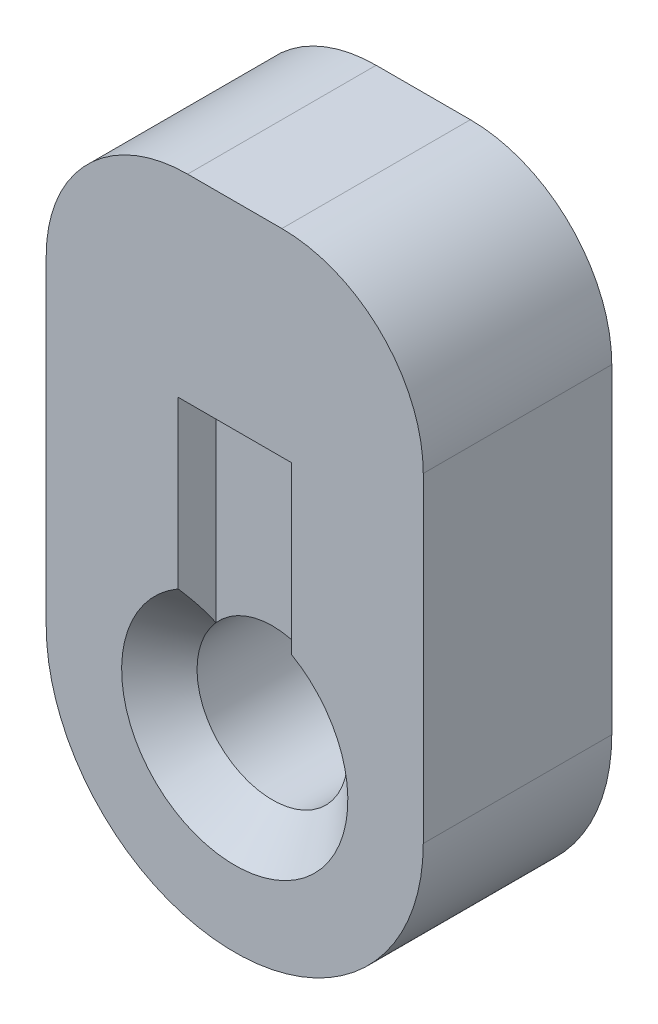
ISO-10303-21;
HEADER;
FILE_DESCRIPTION(('STEP AP214'),'2;1');
FILE_NAME('part.step','',(''),(''),'','','');
FILE_SCHEMA(('AUTOMOTIVE_DESIGN { 1 0 10303 214 1 1 1 1 }'));
ENDSEC;
DATA;
#1=APPLICATION_CONTEXT('core data for automotive mechanical design processes');
#2=APPLICATION_PROTOCOL_DEFINITION('international standard','automotive_design',2000,#1);
#3=PRODUCT_CONTEXT('',#1,'mechanical');
#4=PRODUCT('Part','Part','',(#3));
#5=PRODUCT_RELATED_PRODUCT_CATEGORY('part','',(#4));
#6=PRODUCT_DEFINITION_FORMATION('','',#4);
#7=PRODUCT_DEFINITION_CONTEXT('part definition',#1,'design');
#8=PRODUCT_DEFINITION('design','',#6,#7);
#9=PRODUCT_DEFINITION_SHAPE('','',#8);
#10=(LENGTH_UNIT() NAMED_UNIT(*) SI_UNIT(.MILLI.,.METRE.));
#11=(NAMED_UNIT(*) PLANE_ANGLE_UNIT() SI_UNIT($,.RADIAN.));
#12=(NAMED_UNIT(*) SI_UNIT($,.STERADIAN.) SOLID_ANGLE_UNIT());
#13=UNCERTAINTY_MEASURE_WITH_UNIT(LENGTH_MEASURE(1.E-05),#10,'distance_accuracy_value','');
#14=(GEOMETRIC_REPRESENTATION_CONTEXT(3) GLOBAL_UNCERTAINTY_ASSIGNED_CONTEXT((#13)) GLOBAL_UNIT_ASSIGNED_CONTEXT((#10,
#11,#12)) REPRESENTATION_CONTEXT('',''));
#15=CARTESIAN_POINT('',(0.,0.,0.));
#16=DIRECTION('',(0.,0.,1.));
#17=DIRECTION('',(1.,0.,0.));
#18=AXIS2_PLACEMENT_3D('',#15,#16,#17);
#19=CARTESIAN_POINT('',(0.,0.,2.54));
#20=DIRECTION('',(0.,0.,-1.));
#21=DIRECTION('',(-1.,0.,0.));
#22=AXIS2_PLACEMENT_3D('',#19,#20,#21);
#23=CYLINDRICAL_SURFACE('',#22,1.016);
#24=CARTESIAN_POINT('',(0.,0.,0.508));
#25=DIRECTION('',(0.,0.,-1.));
#26=DIRECTION('',(-1.,0.,0.));
#27=AXIS2_PLACEMENT_3D('',#24,#25,#26);
#28=CIRCLE('',#27,1.016);
#29=CARTESIAN_POINT('',(0.762,0.672020833010429,0.508));
#30=VERTEX_POINT('',#29);
#31=CARTESIAN_POINT('',(-0.762000000000013,0.672020833010416,0.508));
#32=VERTEX_POINT('',#31);
#33=EDGE_CURVE('E519',#30,#32,#28,.F.);
#34=ORIENTED_EDGE('',*,*,#33,.F.);
#35=CARTESIAN_POINT('',(0.,0.,0.508000000000016));
#36=DIRECTION('',(0.,0.,-1.));
#37=DIRECTION('',(-1.,0.,0.));
#38=AXIS2_PLACEMENT_3D('',#35,#36,#37);
#39=CIRCLE('',#38,1.016);
#40=EDGE_CURVE('E139',#30,#32,#39,.T.);
#41=ORIENTED_EDGE('',*,*,#40,.T.);
#42=EDGE_LOOP('',(#34,#41));
#43=FACE_BOUND('',#42,.T.);
#44=CARTESIAN_POINT('',(0.,0.,2.032));
#45=DIRECTION('',(0.,0.,1.));
#46=DIRECTION('',(1.,0.,0.));
#47=AXIS2_PLACEMENT_3D('',#44,#45,#46);
#48=CIRCLE('',#47,1.016);
#49=CARTESIAN_POINT('',(-0.762000000000001,0.672020833010413,2.032));
#50=VERTEX_POINT('',#49);
#51=CARTESIAN_POINT('',(0.762000000000004,0.672020833010409,2.032));
#52=VERTEX_POINT('',#51);
#53=EDGE_CURVE('E179',#50,#52,#48,.F.);
#54=ORIENTED_EDGE('',*,*,#53,.F.);
#55=CARTESIAN_POINT('',(0.,0.,2.03199999999999));
#56=DIRECTION('',(0.,0.,1.));
#57=DIRECTION('',(1.,0.,0.));
#58=AXIS2_PLACEMENT_3D('',#55,#56,#57);
#59=CIRCLE('',#58,1.016);
#60=EDGE_CURVE('E158',#50,#52,#59,.T.);
#61=ORIENTED_EDGE('',*,*,#60,.T.);
#62=EDGE_LOOP('',(#54,#61));
#63=FACE_BOUND('',#62,.T.);
#64=ADVANCED_FACE('F38',(#43,#63),#23,.F.);
#65=CARTESIAN_POINT('',(-0.762000000000001,0.,2.032));
#66=DIRECTION('',(-1.,0.,0.));
#67=DIRECTION('',(0.,0.,1.));
#68=AXIS2_PLACEMENT_3D('',#65,#66,#67);
#69=PLANE('',#68);
#70=CARTESIAN_POINT('',(-0.762000000000001,-0.320112885029406,1.84250847494859));
#71=CARTESIAN_POINT('',(-0.762000000000001,-0.295333553365384,1.83290636944236));
#72=CARTESIAN_POINT('',(-0.762000000000001,-0.270205778967705,1.82412531153175));
#73=CARTESIAN_POINT('',(-0.762000000000001,-0.219279308727766,1.80855318599059));
#74=CARTESIAN_POINT('',(-0.762000000000001,-0.193479145095385,1.80176695346473));
#75=CARTESIAN_POINT('',(-0.762000000000001,-0.141824715607705,1.79068312579393));
#76=CARTESIAN_POINT('',(-0.762000000000001,-0.115979848676879,1.78634278389228));
#77=CARTESIAN_POINT('',(-0.762000000000001,-0.0640080043353284,1.78024889633141));
#78=CARTESIAN_POINT('',(-0.762000000000001,-0.0378813393353045,1.7784927338415));
#79=CARTESIAN_POINT('',(-0.762000000000001,0.0135364612752595,1.77770144140581));
#80=CARTESIAN_POINT('',(-0.762000000000001,0.0388261998534757,1.77857693857625));
#81=CARTESIAN_POINT('',(-0.762000000000001,0.089204692449845,1.78279152828026));
#82=CARTESIAN_POINT('',(-0.762000000000001,0.114293344654479,1.78613179782516));
#83=CARTESIAN_POINT('',(-0.762000000000001,0.188998481514829,1.79956372082769));
#84=CARTESIAN_POINT('',(-0.762000000000001,0.238010241197525,1.81306659996416));
#85=CARTESIAN_POINT('',(-0.762000000000001,0.335647478318469,1.84732319180735));
#86=CARTESIAN_POINT('',(-0.762000000000001,0.384165580939922,1.86836391130572));
#87=CARTESIAN_POINT('',(-0.762000000000001,0.478965921312955,1.91508463327411));
#88=CARTESIAN_POINT('',(-0.762000000000001,0.525243542700618,1.94077373742472));
#89=CARTESIAN_POINT('',(-0.762000000000001,0.616770009042437,1.99563444778393));
#90=CARTESIAN_POINT('',(-0.762000000000001,0.661986045509693,2.02485974331733));
#91=CARTESIAN_POINT('',(-0.762000000000001,0.750951469043454,2.08535304604002));
#92=CARTESIAN_POINT('',(-0.762000000000001,0.794702182311347,2.11661912622096));
#93=CARTESIAN_POINT('',(-0.762000000000001,0.911413460169346,2.2029502583023));
#94=CARTESIAN_POINT('',(-0.762000000000001,0.983379073223906,2.25935171884097));
#95=CARTESIAN_POINT('',(-0.762000000000001,1.12542139977116,2.37449674969511));
#96=CARTESIAN_POINT('',(-0.762000000000001,1.19549743360379,2.43324114438863));
#97=CARTESIAN_POINT('',(-0.762000000000001,1.33448584164571,2.55229764416072));
#98=CARTESIAN_POINT('',(-0.762000000000001,1.40339628502007,2.61261199660617));
#99=CARTESIAN_POINT('',(-0.762000000000001,1.54034092149377,2.73422808104102));
#100=CARTESIAN_POINT('',(-0.762000000000001,1.60837508129857,2.79552985034949));
#101=CARTESIAN_POINT('',(-0.762000000000001,1.73708890097997,2.9127042284456));
#102=CARTESIAN_POINT('',(-0.762000000000001,1.79782808883558,2.96851157096941));
#103=CARTESIAN_POINT('',(-0.762000000000001,1.91891904470457,3.08055019785734));
#104=CARTESIAN_POINT('',(-0.762000000000001,1.97927079436488,3.13678150203428));
#105=CARTESIAN_POINT('',(-0.762000000000001,2.09948522538936,3.24939197548309));
#106=CARTESIAN_POINT('',(-0.762000000000001,2.15934884272821,3.3057701466671));
#107=CARTESIAN_POINT('',(-0.762000000000001,2.27883046181757,3.41877836535408));
#108=CARTESIAN_POINT('',(-0.762000000000001,2.33844847952092,3.47540839598437));
#109=CARTESIAN_POINT('',(-0.762000000000001,2.39797516397831,3.53213371803982));
#110=B_SPLINE_CURVE_WITH_KNOTS('',3,(#70,#71,#72,#73,#74,#75,#76,#77,#78,#79,#80,#81,#82,#83,
#84,#85,#86,#87,#88,#89,#90,#91,#92,#93,#94,#95,#96,#97,#98,#99,#100,#101,#102,#103,#104,#105,
#106,#107,#108,#109),.UNSPECIFIED.,.F.,.F.,(4,2,2,2,2,2,2,2,2,2,2,2,2,2,2,2,2,2,2,4),(0.,
0.0797522408543494,0.159696222594933,0.238195867700949,0.31661596647901,0.392403294084258,
0.468226836116276,0.620003493762815,0.778311228022764,0.936932355595322,1.09836706998341,
1.25965149539109,1.53385513955007,1.80815613042058,2.08287409239533,2.35760246171224,
2.60505370840901,2.85251659170748,3.0992126774344,3.34589247812601),.UNSPECIFIED.);
#111=CARTESIAN_POINT('',(-0.762000000000001,1.31982271536748,2.54));
#112=VERTEX_POINT('',#111);
#113=EDGE_CURVE('E163',#50,#112,#110,.T.);
#114=ORIENTED_EDGE('',*,*,#113,.F.);
#115=DIRECTION('',(0.,-1.,0.));
#116=VECTOR('',#115,1.);
#117=CARTESIAN_POINT('',(-0.762000000000001,0.,2.032));
#118=LINE('',#117,#116);
#119=CARTESIAN_POINT('',(-0.762000000000001,3.556,2.032));
#120=VERTEX_POINT('',#119);
#121=EDGE_CURVE('E176',#120,#50,#118,.T.);
#122=ORIENTED_EDGE('',*,*,#121,.F.);
#123=DIRECTION('',(0.,0.,1.));
#124=VECTOR('',#123,1.);
#125=CARTESIAN_POINT('',(-0.762000000000001,3.556,2.032));
#126=LINE('',#125,#124);
#127=CARTESIAN_POINT('',(-0.762000000000001,3.556,2.54));
#128=VERTEX_POINT('',#127);
#129=EDGE_CURVE('E196',#120,#128,#126,.T.);
#130=ORIENTED_EDGE('',*,*,#129,.T.);
#131=DIRECTION('',(0.,-1.,0.));
#132=VECTOR('',#131,1.);
#133=CARTESIAN_POINT('',(-0.762000000000001,0.,2.54));
#134=LINE('',#133,#132);
#135=EDGE_CURVE('E172',#128,#112,#134,.T.);
#136=ORIENTED_EDGE('',*,*,#135,.T.);
#137=EDGE_LOOP('',(#114,#122,#130,#136));
#138=FACE_BOUND('',#137,.T.);
#139=ADVANCED_FACE('F277',(#138),#69,.F.);
#140=CARTESIAN_POINT('',(0.762000000000001,0.,2.032));
#141=DIRECTION('',(1.,0.,0.));
#142=DIRECTION('',(0.,1.,0.));
#143=AXIS2_PLACEMENT_3D('',#140,#141,#142);
#144=PLANE('',#143);
#145=CARTESIAN_POINT('',(0.762,2.39797516397831,3.53213371803981));
#146=CARTESIAN_POINT('',(0.762,2.32873931674914,3.46616039267172));
#147=CARTESIAN_POINT('',(0.762,2.25938285096078,3.40031275907171));
#148=CARTESIAN_POINT('',(0.762,2.12032476999515,3.26897252871197));
#149=CARTESIAN_POINT('',(0.762,2.050623129003,3.20347995929806));
#150=CARTESIAN_POINT('',(0.762,1.91093693713539,3.07310884917095));
#151=CARTESIAN_POINT('',(0.762,1.840953361568,3.0082292660561));
#152=CARTESIAN_POINT('',(0.762,1.70039435861494,2.87912022187955));
#153=CARTESIAN_POINT('',(0.762,1.6298189537208,2.81489073631485));
#154=CARTESIAN_POINT('',(0.762,1.46664134261578,2.66827439786695));
#155=CARTESIAN_POINT('',(0.762,1.3737586389346,2.58619666171781));
#156=CARTESIAN_POINT('',(0.762,1.23263801134836,2.46495534199683));
#157=CARTESIAN_POINT('',(0.762,1.18524464164697,2.42481050048725));
#158=CARTESIAN_POINT('',(0.762,1.08970679767788,2.34543347189523));
#159=CARTESIAN_POINT('',(0.762,1.04156242296529,2.30620116553391));
#160=CARTESIAN_POINT('',(0.762,0.947477847785198,2.23156286423435));
#161=CARTESIAN_POINT('',(0.762,0.901602549094888,2.19607544441393));
#162=CARTESIAN_POINT('',(0.762,0.80866866053499,2.12668940794581));
#163=CARTESIAN_POINT('',(0.762,0.761610291067495,2.09279049868499));
#164=CARTESIAN_POINT('',(0.762,0.665924682694298,2.02737427180279));
#165=CARTESIAN_POINT('',(0.762,0.617299242056743,1.99585435397701));
#166=CARTESIAN_POINT('',(0.762,0.517890221653922,1.93646959833464));
#167=CARTESIAN_POINT('',(0.762000000000001,0.467109404827834,1.90860025772468));
#168=CARTESIAN_POINT('',(0.762000000000001,0.367695882962378,1.861058228643));
#169=CARTESIAN_POINT('',(0.762000000000001,0.31932355521645,1.84085603108713));
#170=CARTESIAN_POINT('',(0.762000000000001,0.220205152376706,1.8078278857344));
#171=CARTESIAN_POINT('',(0.762000000000001,0.169471551906662,1.79496708311052));
#172=CARTESIAN_POINT('',(0.762000000000001,0.0918201824293839,1.7830719736912));
#173=CARTESIAN_POINT('',(0.762000000000001,0.0654557860224722,1.78034861998438));
#174=CARTESIAN_POINT('',(0.762000000000001,0.0125801610505859,1.77764797533753));
#175=CARTESIAN_POINT('',(0.762000000000001,-0.0139310649855619,1.77767063724941));
#176=CARTESIAN_POINT('',(0.762000000000001,-0.0668797202015237,1.78047036915518));
#177=CARTESIAN_POINT('',(0.762000000000001,-0.0933167177784668,1.78325536159827));
#178=CARTESIAN_POINT('',(0.762000000000001,-0.145795105763024,1.79138862314452));
#179=CARTESIAN_POINT('',(0.762000000000001,-0.171836374335675,1.79673766579477));
#180=CARTESIAN_POINT('',(0.762000000000001,-0.218464555083557,1.80844029670378));
#181=CARTESIAN_POINT('',(0.762000000000001,-0.23915007949053,1.81441154810352));
#182=CARTESIAN_POINT('',(0.762000000000001,-0.279998495995666,1.82758572915144));
#183=CARTESIAN_POINT('',(0.762000000000001,-0.30016367422565,1.83478153796503));
#184=CARTESIAN_POINT('',(0.762000000000001,-0.320112885029432,1.84250847494848));
#185=B_SPLINE_CURVE_WITH_KNOTS('',3,(#145,#146,#147,#148,#149,#150,#151,#152,#153,#154,#155,
#156,#157,#158,#159,#160,#161,#162,#163,#164,#165,#166,#167,#168,#169,#170,#171,#172,#173,#174,
#175,#176,#177,#178,#179,#180,#181,#182,#183,#184),.UNSPECIFIED.,.F.,.F.,(4,2,2,2,2,2,2,2,2,2,2,
2,2,2,2,2,2,2,2,4),(0.,0.28690614863427,0.573834088531817,0.860123242809433,1.14640156599761,
1.51822037764353,1.70454484153626,1.89084481222558,2.06481940011078,2.23876181383742,
2.41251127181324,2.58604435947118,2.74295026876841,2.89910490214274,2.97849141537674,
3.05787656557321,3.13749005510215,3.21712757831782,3.28167668025887,3.34586250911327),.UNSPECIFIED.);
#186=CARTESIAN_POINT('',(0.762,1.31982271536748,2.54));
#187=VERTEX_POINT('',#186);
#188=EDGE_CURVE('E305',#187,#52,#185,.T.);
#189=ORIENTED_EDGE('',*,*,#188,.F.);
#190=DIRECTION('',(0.,1.,0.));
#191=VECTOR('',#190,1.);
#192=CARTESIAN_POINT('',(0.762000000000001,0.,2.54));
#193=LINE('',#192,#191);
#194=CARTESIAN_POINT('',(0.761999999999999,3.556,2.54));
#195=VERTEX_POINT('',#194);
#196=EDGE_CURVE('E192',#187,#195,#193,.T.);
#197=ORIENTED_EDGE('',*,*,#196,.T.);
#198=DIRECTION('',(0.,0.,1.));
#199=VECTOR('',#198,1.);
#200=CARTESIAN_POINT('',(0.761999999999999,3.556,2.032));
#201=LINE('',#200,#199);
#202=CARTESIAN_POINT('',(0.761999999999999,3.556,2.032));
#203=VERTEX_POINT('',#202);
#204=EDGE_CURVE('E189',#203,#195,#201,.T.);
#205=ORIENTED_EDGE('',*,*,#204,.F.);
#206=DIRECTION('',(0.,1.,0.));
#207=VECTOR('',#206,1.);
#208=CARTESIAN_POINT('',(0.762000000000001,0.,2.032));
#209=LINE('',#208,#207);
#210=EDGE_CURVE('E183',#52,#203,#209,.T.);
#211=ORIENTED_EDGE('',*,*,#210,.F.);
#212=EDGE_LOOP('',(#189,#197,#205,#211));
#213=FACE_BOUND('',#212,.T.);
#214=ADVANCED_FACE('F283',(#213),#144,.F.);
#215=CARTESIAN_POINT('',(0.762000000000001,0.,0.508));
#216=DIRECTION('',(1.,0.,0.));
#217=DIRECTION('',(0.,1.,0.));
#218=AXIS2_PLACEMENT_3D('',#215,#216,#217);
#219=PLANE('',#218);
#220=CARTESIAN_POINT('',(0.762000000000001,-0.320112885029424,0.697491525051413));
#221=CARTESIAN_POINT('',(0.762000000000001,-0.2953335533654,0.707093630557645));
#222=CARTESIAN_POINT('',(0.762000000000001,-0.27020577896772,0.715874688468248));
#223=CARTESIAN_POINT('',(0.762000000000001,-0.219279308727779,0.731446814009408));
#224=CARTESIAN_POINT('',(0.762000000000001,-0.193479145095397,0.738233046535275));
#225=CARTESIAN_POINT('',(0.762000000000001,-0.141824715607715,0.749316874206072));
#226=CARTESIAN_POINT('',(0.762000000000001,-0.115979848676887,0.753657216107724));
#227=CARTESIAN_POINT('',(0.762000000000001,-0.0640080043353342,0.759751103668595));
#228=CARTESIAN_POINT('',(0.762000000000001,-0.037881339335309,0.761507266158503));
#229=CARTESIAN_POINT('',(0.762000000000001,0.0135364612752571,0.762298558594195));
#230=CARTESIAN_POINT('',(0.762000000000001,0.0388261998534742,0.761423061423751));
#231=CARTESIAN_POINT('',(0.762000000000001,0.0892046924498453,0.757208471719742));
#232=CARTESIAN_POINT('',(0.762000000000001,0.11429334465448,0.753868202174842));
#233=CARTESIAN_POINT('',(0.762000000000001,0.188998481514833,0.740436279172312));
#234=CARTESIAN_POINT('',(0.762000000000001,0.238010241197531,0.726933400035848));
#235=CARTESIAN_POINT('',(0.762000000000001,0.335647478318479,0.692676808192649));
#236=CARTESIAN_POINT('',(0.762000000000001,0.384165580939933,0.671636088694282));
#237=CARTESIAN_POINT('',(0.762000000000001,0.47896592131297,0.624915366725886));
#238=CARTESIAN_POINT('',(0.762,0.525243542700636,0.59922626257528));
#239=CARTESIAN_POINT('',(0.762,0.616770009042458,0.544365552216063));
#240=CARTESIAN_POINT('',(0.762,0.661986045509717,0.515140256682668));
#241=CARTESIAN_POINT('',(0.762,0.750951469043482,0.454646953959971));
#242=CARTESIAN_POINT('',(0.762,0.794702182311376,0.423380873779028));
#243=CARTESIAN_POINT('',(0.762,0.911413460169378,0.33704974169769));
#244=CARTESIAN_POINT('',(0.762,0.983379073223939,0.280648281159015));
#245=CARTESIAN_POINT('',(0.762,1.1254213997712,0.165503250304881));
#246=CARTESIAN_POINT('',(0.762,1.19549743360383,0.106758855611355));
#247=CARTESIAN_POINT('',(0.762,1.33448584164575,-0.0122976441607343));
#248=CARTESIAN_POINT('',(0.762,1.40339628502011,-0.0726119966061819));
#249=CARTESIAN_POINT('',(0.762,1.54034092149381,-0.194228081041035));
#250=CARTESIAN_POINT('',(0.762,1.60837508129862,-0.255529850349503));
#251=CARTESIAN_POINT('',(0.762,1.73708890098001,-0.372704228445616));
#252=CARTESIAN_POINT('',(0.762,1.79782808883563,-0.42851157096942));
#253=CARTESIAN_POINT('',(0.762,1.91891904470461,-0.540550197857357));
#254=CARTESIAN_POINT('',(0.762,1.97927079436492,-0.596781502034295));
#255=CARTESIAN_POINT('',(0.762,2.09948522538942,-0.709391975483098));
#256=CARTESIAN_POINT('',(0.762,2.15934884272826,-0.765770146667111));
#257=CARTESIAN_POINT('',(0.762,2.27883046181762,-0.878778365354089));
#258=CARTESIAN_POINT('',(0.762,2.33844847952097,-0.935408395984384));
#259=CARTESIAN_POINT('',(0.762,2.39797516397837,-0.99213371803983));
#260=B_SPLINE_CURVE_WITH_KNOTS('',3,(#220,#221,#222,#223,#224,#225,#226,#227,#228,#229,#230,
#231,#232,#233,#234,#235,#236,#237,#238,#239,#240,#241,#242,#243,#244,#245,#246,#247,#248,#249,
#250,#251,#252,#253,#254,#255,#256,#257,#258,#259),.UNSPECIFIED.,.F.,.F.,(4,2,2,2,2,2,2,2,2,2,2,
2,2,2,2,2,2,2,2,4),(0.,0.0797522408543532,0.159696222594941,0.23819586770096,0.316615966479025,
0.392403294084276,0.468226836116297,0.620003493762841,0.778311228022797,0.936932355595361,
1.09836706998345,1.25965149539114,1.53385513955013,1.80815613042064,2.08287409239539,
2.3576024617123,2.60505370840908,2.85251659170755,3.09921267743447,3.34589247812608),.UNSPECIFIED.);
#261=CARTESIAN_POINT('',(0.762,1.31982271536751,0.));
#262=VERTEX_POINT('',#261);
#263=EDGE_CURVE('E136',#30,#262,#260,.T.);
#264=ORIENTED_EDGE('',*,*,#263,.F.);
#265=DIRECTION('',(0.,-1.,0.));
#266=VECTOR('',#265,1.);
#267=CARTESIAN_POINT('',(0.762000000000001,0.,0.508));
#268=LINE('',#267,#266);
#269=CARTESIAN_POINT('',(0.761999999999999,3.556,0.508));
#270=VERTEX_POINT('',#269);
#271=EDGE_CURVE('E170',#270,#30,#268,.T.);
#272=ORIENTED_EDGE('',*,*,#271,.F.);
#273=DIRECTION('',(0.,0.,-1.));
#274=VECTOR('',#273,1.);
#275=CARTESIAN_POINT('',(0.761999999999999,3.556,0.508));
#276=LINE('',#275,#274);
#277=CARTESIAN_POINT('',(0.761999999999999,3.556,0.));
#278=VERTEX_POINT('',#277);
#279=EDGE_CURVE('E156',#270,#278,#276,.T.);
#280=ORIENTED_EDGE('',*,*,#279,.T.);
#281=DIRECTION('',(0.,-1.,0.));
#282=VECTOR('',#281,1.);
#283=CARTESIAN_POINT('',(0.762000000000001,0.,0.));
#284=LINE('',#283,#282);
#285=EDGE_CURVE('E152',#278,#262,#284,.T.);
#286=ORIENTED_EDGE('',*,*,#285,.T.);
#287=EDGE_LOOP('',(#264,#272,#280,#286));
#288=FACE_BOUND('',#287,.T.);
#289=ADVANCED_FACE('F155',(#288),#219,.F.);
#290=CARTESIAN_POINT('',(-0.762000000000001,0.,0.508));
#291=DIRECTION('',(-1.,0.,0.));
#292=DIRECTION('',(0.,0.,1.));
#293=AXIS2_PLACEMENT_3D('',#290,#291,#292);
#294=PLANE('',#293);
#295=CARTESIAN_POINT('',(-0.762000000000001,2.39797516397838,-0.992133718039835));
#296=CARTESIAN_POINT('',(-0.762000000000001,2.3287393167492,-0.92616039267174));
#297=CARTESIAN_POINT('',(-0.762000000000001,2.25938285096084,-0.860312759071731));
#298=CARTESIAN_POINT('',(-0.762000000000001,2.12032476999521,-0.728972528711984));
#299=CARTESIAN_POINT('',(-0.762000000000001,2.05062312900305,-0.663479959298074));
#300=CARTESIAN_POINT('',(-0.762000000000001,1.91093693713544,-0.533108849170966));
#301=CARTESIAN_POINT('',(-0.762000000000001,1.84095336156804,-0.468229266056115));
#302=CARTESIAN_POINT('',(-0.762000000000001,1.70039435861499,-0.339120221879564));
#303=CARTESIAN_POINT('',(-0.762000000000001,1.62981895372084,-0.274890736314859));
#304=CARTESIAN_POINT('',(-0.762000000000001,1.46664134261582,-0.128274397866957));
#305=CARTESIAN_POINT('',(-0.762000000000001,1.37375863893464,-0.0461966617178121));
#306=CARTESIAN_POINT('',(-0.762000000000001,1.23263801134839,0.0750446580031614));
#307=CARTESIAN_POINT('',(-0.762000000000001,1.18524464164699,0.115189499512746));
#308=CARTESIAN_POINT('',(-0.762000000000001,1.0897067976779,0.194566528104768));
#309=CARTESIAN_POINT('',(-0.762000000000001,1.04156242296531,0.233798834466091));
#310=CARTESIAN_POINT('',(-0.762000000000001,0.947477847785219,0.308437135765644));
#311=CARTESIAN_POINT('',(-0.762000000000001,0.901602549094908,0.343924555586069));
#312=CARTESIAN_POINT('',(-0.762000000000001,0.808668660535009,0.413310592054184));
#313=CARTESIAN_POINT('',(-0.762000000000001,0.761610291067513,0.447209501315008));
#314=CARTESIAN_POINT('',(-0.762000000000001,0.665924682694314,0.512625728197209));
#315=CARTESIAN_POINT('',(-0.762000000000001,0.617299242056758,0.544145646022987));
#316=CARTESIAN_POINT('',(-0.762000000000001,0.517890221653935,0.603530401665366));
#317=CARTESIAN_POINT('',(-0.762000000000001,0.467109404827846,0.631399742275319));
#318=CARTESIAN_POINT('',(-0.762000000000001,0.367695882962388,0.678941771356999));
#319=CARTESIAN_POINT('',(-0.762000000000001,0.319323555216459,0.699143968912871));
#320=CARTESIAN_POINT('',(-0.762000000000001,0.220205152376712,0.732172114265605));
#321=CARTESIAN_POINT('',(-0.762000000000001,0.169471551906666,0.745032916889488));
#322=CARTESIAN_POINT('',(-0.762000000000001,0.0918201824293863,0.756928026308806));
#323=CARTESIAN_POINT('',(-0.762000000000001,0.0654557860224739,0.759651380015625));
#324=CARTESIAN_POINT('',(-0.762000000000001,0.0125801610505861,0.762352024662472));
#325=CARTESIAN_POINT('',(-0.762000000000001,-0.0139310649855625,0.762329362750596));
#326=CARTESIAN_POINT('',(-0.762000000000001,-0.0668797202015259,0.759529630844824));
#327=CARTESIAN_POINT('',(-0.762000000000001,-0.09331671777847,0.756744638401739));
#328=CARTESIAN_POINT('',(-0.762000000000001,-0.145795105763029,0.748611376855485));
#329=CARTESIAN_POINT('',(-0.762000000000001,-0.17183637433568,0.743262334205238));
#330=CARTESIAN_POINT('',(-0.762000000000001,-0.218464555083565,0.731559703296227));
#331=CARTESIAN_POINT('',(-0.762000000000001,-0.239150079490541,0.725588451896481));
#332=CARTESIAN_POINT('',(-0.762000000000001,-0.279998495995681,0.712414270848565));
#333=CARTESIAN_POINT('',(-0.762000000000001,-0.300163674225667,0.70521846203497));
#334=CARTESIAN_POINT('',(-0.762000000000001,-0.320112885029451,0.69749152505152));
#335=B_SPLINE_CURVE_WITH_KNOTS('',3,(#295,#296,#297,#298,#299,#300,#301,#302,#303,#304,#305,
#306,#307,#308,#309,#310,#311,#312,#313,#314,#315,#316,#317,#318,#319,#320,#321,#322,#323,#324,
#325,#326,#327,#328,#329,#330,#331,#332,#333,#334),.UNSPECIFIED.,.F.,.F.,(4,2,2,2,2,2,2,2,2,2,2,
2,2,2,2,2,2,2,2,4),(0.,0.286906148634278,0.573834088531832,0.860123242809456,1.14640156599764,
1.51822037764357,1.7045448415363,1.89084481222563,2.06481940011083,2.23876181383748,
2.4125112718133,2.58604435947124,2.74295026876847,2.89910490214281,2.97849141537681,
3.05787656557328,3.13749005510222,3.21712757831789,3.28167668025895,3.34586250911335),.UNSPECIFIED.);
#336=CARTESIAN_POINT('',(-0.762000000000001,1.31982271536751,0.));
#337=VERTEX_POINT('',#336);
#338=EDGE_CURVE('E144',#337,#32,#335,.T.);
#339=ORIENTED_EDGE('',*,*,#338,.F.);
#340=DIRECTION('',(0.,1.,0.));
#341=VECTOR('',#340,1.);
#342=CARTESIAN_POINT('',(-0.762000000000001,0.,0.));
#343=LINE('',#342,#341);
#344=CARTESIAN_POINT('',(-0.762000000000001,3.556,0.));
#345=VERTEX_POINT('',#344);
#346=EDGE_CURVE('E153',#337,#345,#343,.T.);
#347=ORIENTED_EDGE('',*,*,#346,.T.);
#348=DIRECTION('',(0.,0.,-1.));
#349=VECTOR('',#348,1.);
#350=CARTESIAN_POINT('',(-0.762000000000001,3.556,0.508));
#351=LINE('',#350,#349);
#352=CARTESIAN_POINT('',(-0.762000000000001,3.556,0.508));
#353=VERTEX_POINT('',#352);
#354=EDGE_CURVE('E173',#353,#345,#351,.T.);
#355=ORIENTED_EDGE('',*,*,#354,.F.);
#356=DIRECTION('',(0.,1.,0.));
#357=VECTOR('',#356,1.);
#358=CARTESIAN_POINT('',(-0.762000000000001,0.,0.508));
#359=LINE('',#358,#357);
#360=EDGE_CURVE('E521',#32,#353,#359,.T.);
#361=ORIENTED_EDGE('',*,*,#360,.F.);
#362=EDGE_LOOP('',(#339,#347,#355,#361));
#363=FACE_BOUND('',#362,.T.);
#364=ADVANCED_FACE('F328',(#363),#294,.F.);
#365=CARTESIAN_POINT('',(-2.54,0.,2.54));
#366=DIRECTION('',(-1.,0.,0.));
#367=DIRECTION('',(0.,0.,1.));
#368=AXIS2_PLACEMENT_3D('',#365,#366,#367);
#369=PLANE('',#368);
#370=DIRECTION('',(0.,1.,0.));
#371=VECTOR('',#370,1.);
#372=CARTESIAN_POINT('',(-2.54,0.,0.));
#373=LINE('',#372,#371);
#374=CARTESIAN_POINT('',(-2.54,0.,0.));
#375=VERTEX_POINT('',#374);
#376=CARTESIAN_POINT('',(-2.54,4.318,0.));
#377=VERTEX_POINT('',#376);
#378=EDGE_CURVE('E198',#375,#377,#373,.T.);
#379=ORIENTED_EDGE('',*,*,#378,.F.);
#380=DIRECTION('',(0.,0.,-1.));
#381=VECTOR('',#380,1.);
#382=CARTESIAN_POINT('',(-2.54,0.,2.54));
#383=LINE('',#382,#381);
#384=CARTESIAN_POINT('',(-2.54,0.,2.54));
#385=VERTEX_POINT('',#384);
#386=EDGE_CURVE('E11',#385,#375,#383,.T.);
#387=ORIENTED_EDGE('',*,*,#386,.F.);
#388=DIRECTION('',(0.,1.,0.));
#389=VECTOR('',#388,1.);
#390=CARTESIAN_POINT('',(-2.54,0.,2.54));
#391=LINE('',#390,#389);
#392=CARTESIAN_POINT('',(-2.54,4.318,2.54));
#393=VERTEX_POINT('',#392);
#394=EDGE_CURVE('E201',#385,#393,#391,.T.);
#395=ORIENTED_EDGE('',*,*,#394,.T.);
#396=DIRECTION('',(0.,0.,-1.));
#397=VECTOR('',#396,1.);
#398=CARTESIAN_POINT('',(-2.54,4.318,2.54));
#399=LINE('',#398,#397);
#400=EDGE_CURVE('E217',#393,#377,#399,.T.);
#401=ORIENTED_EDGE('',*,*,#400,.T.);
#402=EDGE_LOOP('',(#379,#387,#395,#401));
#403=FACE_BOUND('',#402,.T.);
#404=ADVANCED_FACE('F40',(#403),#369,.T.);
#405=CARTESIAN_POINT('',(0.,0.,2.54));
#406=DIRECTION('',(0.,0.,-1.));
#407=DIRECTION('',(-1.,0.,0.));
#408=AXIS2_PLACEMENT_3D('',#405,#406,#407);
#409=CYLINDRICAL_SURFACE('',#408,2.54);
#410=CARTESIAN_POINT('',(0.,0.,0.));
#411=DIRECTION('',(0.,0.,1.));
#412=DIRECTION('',(1.,0.,0.));
#413=AXIS2_PLACEMENT_3D('',#410,#411,#412);
#414=CIRCLE('',#413,2.54);
#415=CARTESIAN_POINT('',(2.54,0.,0.));
#416=VERTEX_POINT('',#415);
#417=EDGE_CURVE('E220',#375,#416,#414,.T.);
#418=ORIENTED_EDGE('',*,*,#417,.T.);
#419=DIRECTION('',(0.,0.,-1.));
#420=VECTOR('',#419,1.);
#421=CARTESIAN_POINT('',(2.54,0.,2.54));
#422=LINE('',#421,#420);
#423=CARTESIAN_POINT('',(2.54,0.,2.54));
#424=VERTEX_POINT('',#423);
#425=EDGE_CURVE('E46',#424,#416,#422,.T.);
#426=ORIENTED_EDGE('',*,*,#425,.F.);
#427=CARTESIAN_POINT('',(0.,0.,2.54));
#428=DIRECTION('',(0.,0.,1.));
#429=DIRECTION('',(1.,0.,0.));
#430=AXIS2_PLACEMENT_3D('',#427,#428,#429);
#431=CIRCLE('',#430,2.54);
#432=EDGE_CURVE('E204',#385,#424,#431,.T.);
#433=ORIENTED_EDGE('',*,*,#432,.F.);
#434=ORIENTED_EDGE('',*,*,#386,.T.);
#435=EDGE_LOOP('',(#418,#426,#433,#434));
#436=FACE_BOUND('',#435,.T.);
#437=ADVANCED_FACE('F261',(#436),#409,.T.);
#438=CARTESIAN_POINT('',(2.54,0.,2.54));
#439=DIRECTION('',(-1.,0.,0.));
#440=DIRECTION('',(0.,-1.,0.));
#441=AXIS2_PLACEMENT_3D('',#438,#439,#440);
#442=PLANE('',#441);
#443=DIRECTION('',(0.,1.,0.));
#444=VECTOR('',#443,1.);
#445=CARTESIAN_POINT('',(2.54,0.,0.));
#446=LINE('',#445,#444);
#447=CARTESIAN_POINT('',(2.54,4.318,0.));
#448=VERTEX_POINT('',#447);
#449=EDGE_CURVE('E222',#416,#448,#446,.T.);
#450=ORIENTED_EDGE('',*,*,#449,.T.);
#451=DIRECTION('',(0.,0.,-1.));
#452=VECTOR('',#451,1.);
#453=CARTESIAN_POINT('',(2.54,4.318,2.54));
#454=LINE('',#453,#452);
#455=CARTESIAN_POINT('',(2.54,4.318,2.54));
#456=VERTEX_POINT('',#455);
#457=EDGE_CURVE('E237',#456,#448,#454,.T.);
#458=ORIENTED_EDGE('',*,*,#457,.F.);
#459=DIRECTION('',(0.,1.,0.));
#460=VECTOR('',#459,1.);
#461=CARTESIAN_POINT('',(2.54,0.,2.54));
#462=LINE('',#461,#460);
#463=EDGE_CURVE('E207',#424,#456,#462,.T.);
#464=ORIENTED_EDGE('',*,*,#463,.F.);
#465=ORIENTED_EDGE('',*,*,#425,.T.);
#466=EDGE_LOOP('',(#450,#458,#464,#465));
#467=FACE_BOUND('',#466,.T.);
#468=ADVANCED_FACE('F244',(#467),#442,.F.);
#469=CARTESIAN_POINT('',(0.635,4.318,2.54));
#470=DIRECTION('',(0.,0.,-1.));
#471=DIRECTION('',(-1.,0.,0.));
#472=AXIS2_PLACEMENT_3D('',#469,#470,#471);
#473=CYLINDRICAL_SURFACE('',#472,1.905);
#474=CARTESIAN_POINT('',(0.635,4.318,0.));
#475=DIRECTION('',(0.,0.,1.));
#476=DIRECTION('',(1.,0.,0.));
#477=AXIS2_PLACEMENT_3D('',#474,#475,#476);
#478=CIRCLE('',#477,1.905);
#479=CARTESIAN_POINT('',(0.635,6.223,0.));
#480=VERTEX_POINT('',#479);
#481=EDGE_CURVE('E224',#448,#480,#478,.T.);
#482=ORIENTED_EDGE('',*,*,#481,.T.);
#483=DIRECTION('',(0.,0.,-1.));
#484=VECTOR('',#483,1.);
#485=CARTESIAN_POINT('',(0.635,6.223,2.54));
#486=LINE('',#485,#484);
#487=CARTESIAN_POINT('',(0.635,6.223,2.54));
#488=VERTEX_POINT('',#487);
#489=EDGE_CURVE('E235',#488,#480,#486,.T.);
#490=ORIENTED_EDGE('',*,*,#489,.F.);
#491=CARTESIAN_POINT('',(0.635,4.318,2.54));
#492=DIRECTION('',(0.,0.,1.));
#493=DIRECTION('',(1.,0.,0.));
#494=AXIS2_PLACEMENT_3D('',#491,#492,#493);
#495=CIRCLE('',#494,1.905);
#496=EDGE_CURVE('E209',#456,#488,#495,.T.);
#497=ORIENTED_EDGE('',*,*,#496,.F.);
#498=ORIENTED_EDGE('',*,*,#457,.T.);
#499=EDGE_LOOP('',(#482,#490,#497,#498));
#500=FACE_BOUND('',#499,.T.);
#501=ADVANCED_FACE('F254',(#500),#473,.T.);
#502=CARTESIAN_POINT('',(0.,6.223,2.54));
#503=DIRECTION('',(0.,1.,0.));
#504=DIRECTION('',(0.,0.,1.));
#505=AXIS2_PLACEMENT_3D('',#502,#503,#504);
#506=PLANE('',#505);
#507=DIRECTION('',(1.,0.,0.));
#508=VECTOR('',#507,1.);
#509=CARTESIAN_POINT('',(0.,6.223,0.));
#510=LINE('',#509,#508);
#511=CARTESIAN_POINT('',(-0.635,6.223,0.));
#512=VERTEX_POINT('',#511);
#513=EDGE_CURVE('E227',#512,#480,#510,.T.);
#514=ORIENTED_EDGE('',*,*,#513,.F.);
#515=DIRECTION('',(0.,0.,-1.));
#516=VECTOR('',#515,1.);
#517=CARTESIAN_POINT('',(-0.635,6.223,2.54));
#518=LINE('',#517,#516);
#519=CARTESIAN_POINT('',(-0.635,6.223,2.54));
#520=VERTEX_POINT('',#519);
#521=EDGE_CURVE('E233',#520,#512,#518,.T.);
#522=ORIENTED_EDGE('',*,*,#521,.F.);
#523=DIRECTION('',(1.,0.,0.));
#524=VECTOR('',#523,1.);
#525=CARTESIAN_POINT('',(0.,6.223,2.54));
#526=LINE('',#525,#524);
#527=EDGE_CURVE('E211',#520,#488,#526,.T.);
#528=ORIENTED_EDGE('',*,*,#527,.T.);
#529=ORIENTED_EDGE('',*,*,#489,.T.);
#530=EDGE_LOOP('',(#514,#522,#528,#529));
#531=FACE_BOUND('',#530,.T.);
#532=ADVANCED_FACE('F267',(#531),#506,.T.);
#533=CARTESIAN_POINT('',(-0.635,4.318,2.54));
#534=DIRECTION('',(0.,0.,-1.));
#535=DIRECTION('',(-1.,0.,0.));
#536=AXIS2_PLACEMENT_3D('',#533,#534,#535);
#537=CYLINDRICAL_SURFACE('',#536,1.905);
#538=CARTESIAN_POINT('',(-0.635,4.318,0.));
#539=DIRECTION('',(0.,0.,1.));
#540=DIRECTION('',(1.,0.,0.));
#541=AXIS2_PLACEMENT_3D('',#538,#539,#540);
#542=CIRCLE('',#541,1.905);
#543=EDGE_CURVE('E205',#377,#512,#542,.F.);
#544=ORIENTED_EDGE('',*,*,#543,.F.);
#545=ORIENTED_EDGE('',*,*,#400,.F.);
#546=CARTESIAN_POINT('',(-0.635,4.318,2.54));
#547=DIRECTION('',(0.,0.,1.));
#548=DIRECTION('',(1.,0.,0.));
#549=AXIS2_PLACEMENT_3D('',#546,#547,#548);
#550=CIRCLE('',#549,1.905);
#551=EDGE_CURVE('E214',#393,#520,#550,.F.);
#552=ORIENTED_EDGE('',*,*,#551,.T.);
#553=ORIENTED_EDGE('',*,*,#521,.T.);
#554=EDGE_LOOP('',(#544,#545,#552,#553));
#555=FACE_BOUND('',#554,.T.);
#556=ADVANCED_FACE('F265',(#555),#537,.T.);
#557=CARTESIAN_POINT('',(0.,0.,2.54));
#558=DIRECTION('',(0.,0.,1.));
#559=DIRECTION('',(1.,0.,0.));
#560=AXIS2_PLACEMENT_3D('',#557,#558,#559);
#561=PLANE('',#560);
#562=ORIENTED_EDGE('',*,*,#196,.F.);
#563=CARTESIAN_POINT('',(0.,0.,2.54));
#564=DIRECTION('',(0.,0.,-1.));
#565=DIRECTION('',(-1.,0.,0.));
#566=AXIS2_PLACEMENT_3D('',#563,#564,#565);
#567=CIRCLE('',#566,1.524);
#568=EDGE_CURVE('E53',#187,#112,#567,.T.);
#569=ORIENTED_EDGE('',*,*,#568,.T.);
#570=ORIENTED_EDGE('',*,*,#135,.F.);
#571=DIRECTION('',(-1.,0.,0.));
#572=VECTOR('',#571,1.);
#573=CARTESIAN_POINT('',(0.,3.556,2.54));
#574=LINE('',#573,#572);
#575=EDGE_CURVE('E180',#195,#128,#574,.T.);
#576=ORIENTED_EDGE('',*,*,#575,.F.);
#577=EDGE_LOOP('',(#562,#569,#570,#576));
#578=FACE_BOUND('',#577,.T.);
#579=ORIENTED_EDGE('',*,*,#394,.F.);
#580=ORIENTED_EDGE('',*,*,#432,.T.);
#581=ORIENTED_EDGE('',*,*,#463,.T.);
#582=ORIENTED_EDGE('',*,*,#496,.T.);
#583=ORIENTED_EDGE('',*,*,#527,.F.);
#584=ORIENTED_EDGE('',*,*,#551,.F.);
#585=EDGE_LOOP('',(#579,#580,#581,#582,#583,#584));
#586=FACE_BOUND('',#585,.T.);
#587=ADVANCED_FACE('F259',(#578,#586),#561,.T.);
#588=CARTESIAN_POINT('',(0.,0.,0.));
#589=DIRECTION('',(0.,0.,1.));
#590=DIRECTION('',(1.,0.,0.));
#591=AXIS2_PLACEMENT_3D('',#588,#589,#590);
#592=PLANE('',#591);
#593=CARTESIAN_POINT('',(0.,0.,0.));
#594=DIRECTION('',(0.,0.,-1.));
#595=DIRECTION('',(-1.,0.,0.));
#596=AXIS2_PLACEMENT_3D('',#593,#594,#595);
#597=CIRCLE('',#596,1.52400000000002);
#598=EDGE_CURVE('E61',#262,#337,#597,.T.);
#599=ORIENTED_EDGE('',*,*,#598,.F.);
#600=ORIENTED_EDGE('',*,*,#285,.F.);
#601=DIRECTION('',(1.,0.,0.));
#602=VECTOR('',#601,1.);
#603=CARTESIAN_POINT('',(0.,3.556,0.));
#604=LINE('',#603,#602);
#605=EDGE_CURVE('E160',#345,#278,#604,.T.);
#606=ORIENTED_EDGE('',*,*,#605,.F.);
#607=ORIENTED_EDGE('',*,*,#346,.F.);
#608=EDGE_LOOP('',(#599,#600,#606,#607));
#609=FACE_BOUND('',#608,.T.);
#610=ORIENTED_EDGE('',*,*,#378,.T.);
#611=ORIENTED_EDGE('',*,*,#543,.T.);
#612=ORIENTED_EDGE('',*,*,#513,.T.);
#613=ORIENTED_EDGE('',*,*,#481,.F.);
#614=ORIENTED_EDGE('',*,*,#449,.F.);
#615=ORIENTED_EDGE('',*,*,#417,.F.);
#616=EDGE_LOOP('',(#610,#611,#612,#613,#614,#615));
#617=FACE_BOUND('',#616,.T.);
#618=ADVANCED_FACE('F149',(#609,#617),#592,.F.);
#619=CARTESIAN_POINT('',(0.,3.556,2.032));
#620=DIRECTION('',(0.,1.,0.));
#621=DIRECTION('',(-1.,0.,0.));
#622=AXIS2_PLACEMENT_3D('',#619,#620,#621);
#623=PLANE('',#622);
#624=ORIENTED_EDGE('',*,*,#575,.T.);
#625=ORIENTED_EDGE('',*,*,#129,.F.);
#626=DIRECTION('',(-1.,0.,0.));
#627=VECTOR('',#626,1.);
#628=CARTESIAN_POINT('',(0.,3.556,2.032));
#629=LINE('',#628,#627);
#630=EDGE_CURVE('E186',#203,#120,#629,.T.);
#631=ORIENTED_EDGE('',*,*,#630,.F.);
#632=ORIENTED_EDGE('',*,*,#204,.T.);
#633=EDGE_LOOP('',(#624,#625,#631,#632));
#634=FACE_BOUND('',#633,.T.);
#635=ADVANCED_FACE('F291',(#634),#623,.F.);
#636=CARTESIAN_POINT('',(0.,0.,2.032));
#637=DIRECTION('',(0.,0.,1.));
#638=DIRECTION('',(1.,0.,0.));
#639=AXIS2_PLACEMENT_3D('',#636,#637,#638);
#640=PLANE('',#639);
#641=ORIENTED_EDGE('',*,*,#121,.T.);
#642=ORIENTED_EDGE('',*,*,#53,.T.);
#643=ORIENTED_EDGE('',*,*,#210,.T.);
#644=ORIENTED_EDGE('',*,*,#630,.T.);
#645=EDGE_LOOP('',(#641,#642,#643,#644));
#646=FACE_BOUND('',#645,.T.);
#647=ADVANCED_FACE('F326',(#646),#640,.T.);
#648=CARTESIAN_POINT('',(0.,3.556,0.508));
#649=DIRECTION('',(0.,1.,0.));
#650=DIRECTION('',(-1.,0.,0.));
#651=AXIS2_PLACEMENT_3D('',#648,#649,#650);
#652=PLANE('',#651);
#653=ORIENTED_EDGE('',*,*,#605,.T.);
#654=ORIENTED_EDGE('',*,*,#279,.F.);
#655=DIRECTION('',(1.,0.,0.));
#656=VECTOR('',#655,1.);
#657=CARTESIAN_POINT('',(0.,3.556,0.508));
#658=LINE('',#657,#656);
#659=EDGE_CURVE('E166',#353,#270,#658,.T.);
#660=ORIENTED_EDGE('',*,*,#659,.F.);
#661=ORIENTED_EDGE('',*,*,#354,.T.);
#662=EDGE_LOOP('',(#653,#654,#660,#661));
#663=FACE_BOUND('',#662,.T.);
#664=ADVANCED_FACE('F322',(#663),#652,.F.);
#665=CARTESIAN_POINT('',(0.,0.,0.508));
#666=DIRECTION('',(0.,0.,-1.));
#667=DIRECTION('',(-1.,0.,0.));
#668=AXIS2_PLACEMENT_3D('',#665,#666,#667);
#669=PLANE('',#668);
#670=ORIENTED_EDGE('',*,*,#271,.T.);
#671=ORIENTED_EDGE('',*,*,#33,.T.);
#672=ORIENTED_EDGE('',*,*,#360,.T.);
#673=ORIENTED_EDGE('',*,*,#659,.T.);
#674=EDGE_LOOP('',(#670,#671,#672,#673));
#675=FACE_BOUND('',#674,.T.);
#676=ADVANCED_FACE('F318',(#675),#669,.T.);
#677=CARTESIAN_POINT('',(0.,0.,1.01600000000001));
#678=DIRECTION('',(0.,0.,-1.));
#679=DIRECTION('',(-1.,0.,0.));
#680=AXIS2_PLACEMENT_3D('',#677,#678,#679);
#681=CONICAL_SURFACE('',#680,0.508,0.785398163397453);
#682=ORIENTED_EDGE('',*,*,#263,.T.);
#683=ORIENTED_EDGE('',*,*,#598,.T.);
#684=ORIENTED_EDGE('',*,*,#338,.T.);
#685=ORIENTED_EDGE('',*,*,#40,.F.);
#686=EDGE_LOOP('',(#682,#683,#684,#685));
#687=FACE_BOUND('',#686,.T.);
#688=ADVANCED_FACE('F137',(#687),#681,.F.);
#689=CARTESIAN_POINT('',(0.,0.,2.54));
#690=DIRECTION('',(0.,0.,1.));
#691=DIRECTION('',(1.,0.,0.));
#692=AXIS2_PLACEMENT_3D('',#689,#690,#691);
#693=CONICAL_SURFACE('',#692,1.524,0.785398163397443);
#694=ORIENTED_EDGE('',*,*,#113,.T.);
#695=ORIENTED_EDGE('',*,*,#568,.F.);
#696=ORIENTED_EDGE('',*,*,#188,.T.);
#697=ORIENTED_EDGE('',*,*,#60,.F.);
#698=EDGE_LOOP('',(#694,#695,#696,#697));
#699=FACE_BOUND('',#698,.T.);
#700=ADVANCED_FACE('F312',(#699),#693,.F.);
#701=CLOSED_SHELL('',(#64,#139,#214,#289,#364,#404,#437,#468,#501,#532,#556,#587,#618,#635,#647,
#664,#676,#688,#700));
#702=MANIFOLD_SOLID_BREP('B2',#701);
#703=ADVANCED_BREP_SHAPE_REPRESENTATION('',(#18,#702),#14);
#704=SHAPE_DEFINITION_REPRESENTATION(#9,#703);
ENDSEC;
END-ISO-10303-21;
